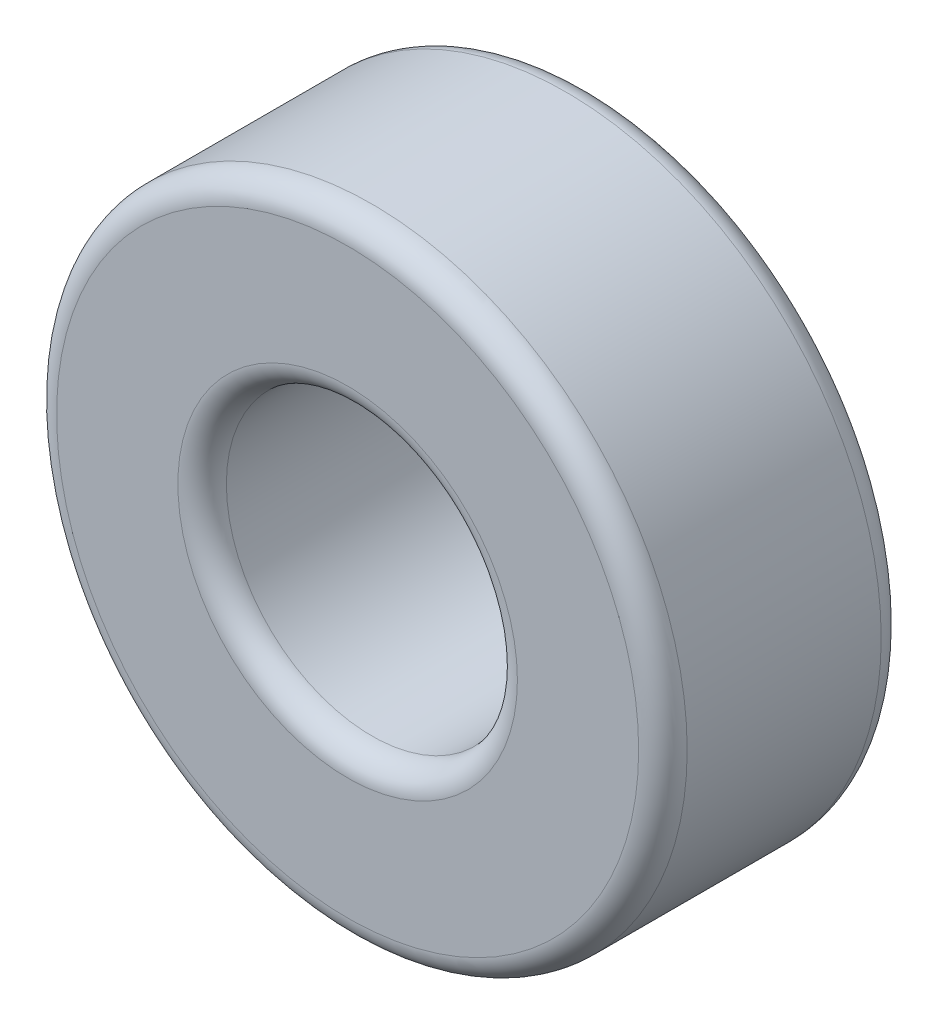
ISO-10303-21;
HEADER;
FILE_DESCRIPTION(('STEP AP214'),'2;1');
FILE_NAME('part.step','',(''),(''),'','','');
FILE_SCHEMA(('AUTOMOTIVE_DESIGN { 1 0 10303 214 1 1 1 1 }'));
ENDSEC;
DATA;
#1=APPLICATION_CONTEXT('core data for automotive mechanical design processes');
#2=APPLICATION_PROTOCOL_DEFINITION('international standard','automotive_design',2000,#1);
#3=PRODUCT_CONTEXT('',#1,'mechanical');
#4=PRODUCT('Part','Part','',(#3));
#5=PRODUCT_RELATED_PRODUCT_CATEGORY('part','',(#4));
#6=PRODUCT_DEFINITION_FORMATION('','',#4);
#7=PRODUCT_DEFINITION_CONTEXT('part definition',#1,'design');
#8=PRODUCT_DEFINITION('design','',#6,#7);
#9=PRODUCT_DEFINITION_SHAPE('','',#8);
#10=(LENGTH_UNIT() NAMED_UNIT(*) SI_UNIT(.MILLI.,.METRE.));
#11=(NAMED_UNIT(*) PLANE_ANGLE_UNIT() SI_UNIT($,.RADIAN.));
#12=(NAMED_UNIT(*) SI_UNIT($,.STERADIAN.) SOLID_ANGLE_UNIT());
#13=UNCERTAINTY_MEASURE_WITH_UNIT(LENGTH_MEASURE(1.E-05),#10,'distance_accuracy_value','');
#14=(GEOMETRIC_REPRESENTATION_CONTEXT(3) GLOBAL_UNCERTAINTY_ASSIGNED_CONTEXT((#13)) GLOBAL_UNIT_ASSIGNED_CONTEXT((#10,
#11,#12)) REPRESENTATION_CONTEXT('',''));
#15=CARTESIAN_POINT('',(0.,0.,0.));
#16=DIRECTION('',(0.,0.,1.));
#17=DIRECTION('',(1.,0.,0.));
#18=AXIS2_PLACEMENT_3D('',#15,#16,#17);
#19=CARTESIAN_POINT('',(0.,0.,0.));
#20=DIRECTION('',(0.,0.,1.));
#21=DIRECTION('',(1.,0.,0.));
#22=AXIS2_PLACEMENT_3D('',#19,#20,#21);
#23=CYLINDRICAL_SURFACE('',#22,3.);
#24=CARTESIAN_POINT('',(0.,0.,0.5));
#25=DIRECTION('',(0.,0.,1.));
#26=DIRECTION('',(1.,0.,0.));
#27=AXIS2_PLACEMENT_3D('',#24,#25,#26);
#28=CIRCLE('',#27,3.);
#29=CARTESIAN_POINT('',(3.,0.,0.5));
#30=VERTEX_POINT('',#29);
#31=EDGE_CURVE('E108',#30,#30,#28,.T.);
#32=ORIENTED_EDGE('',*,*,#31,.F.);
#33=EDGE_LOOP('',(#32));
#34=FACE_BOUND('',#33,.T.);
#35=CARTESIAN_POINT('',(0.,0.,4.5));
#36=DIRECTION('',(0.,0.,-1.));
#37=DIRECTION('',(-1.,0.,0.));
#38=AXIS2_PLACEMENT_3D('',#35,#36,#37);
#39=CIRCLE('',#38,3.);
#40=CARTESIAN_POINT('',(-3.,0.,4.5));
#41=VERTEX_POINT('',#40);
#42=EDGE_CURVE('E112',#41,#41,#39,.T.);
#43=ORIENTED_EDGE('',*,*,#42,.F.);
#44=EDGE_LOOP('',(#43));
#45=FACE_BOUND('',#44,.T.);
#46=ADVANCED_FACE('F15',(#34,#45),#23,.F.);
#47=CARTESIAN_POINT('',(0.,0.,4.5));
#48=DIRECTION('',(0.,0.,-1.));
#49=DIRECTION('',(-1.,0.,0.));
#50=AXIS2_PLACEMENT_3D('',#47,#48,#49);
#51=TOROIDAL_SURFACE('',#50,3.5,0.5);
#52=CARTESIAN_POINT('',(0.,0.,5.));
#53=DIRECTION('',(0.,0.,1.));
#54=DIRECTION('',(1.,0.,0.));
#55=AXIS2_PLACEMENT_3D('',#52,#53,#54);
#56=CIRCLE('',#55,3.5);
#57=CARTESIAN_POINT('',(3.5,0.,5.));
#58=VERTEX_POINT('',#57);
#59=EDGE_CURVE('E111',#58,#58,#56,.F.);
#60=ORIENTED_EDGE('',*,*,#59,.F.);
#61=EDGE_LOOP('',(#60));
#62=FACE_BOUND('',#61,.T.);
#63=ORIENTED_EDGE('',*,*,#42,.T.);
#64=EDGE_LOOP('',(#63));
#65=FACE_BOUND('',#64,.T.);
#66=ADVANCED_FACE('F131',(#62,#65),#51,.T.);
#67=CARTESIAN_POINT('',(0.,0.,0.5));
#68=DIRECTION('',(0.,0.,1.));
#69=DIRECTION('',(1.,0.,0.));
#70=AXIS2_PLACEMENT_3D('',#67,#68,#69);
#71=TOROIDAL_SURFACE('',#70,3.5,0.5);
#72=CARTESIAN_POINT('',(0.,0.,0.));
#73=DIRECTION('',(0.,0.,-1.));
#74=DIRECTION('',(1.,0.,0.));
#75=AXIS2_PLACEMENT_3D('',#72,#73,#74);
#76=CIRCLE('',#75,3.5);
#77=CARTESIAN_POINT('',(3.5,0.,0.));
#78=VERTEX_POINT('',#77);
#79=EDGE_CURVE('E119',#78,#78,#76,.T.);
#80=ORIENTED_EDGE('',*,*,#79,.T.);
#81=EDGE_LOOP('',(#80));
#82=FACE_BOUND('',#81,.T.);
#83=ORIENTED_EDGE('',*,*,#31,.T.);
#84=EDGE_LOOP('',(#83));
#85=FACE_BOUND('',#84,.T.);
#86=ADVANCED_FACE('F83',(#82,#85),#71,.T.);
#87=CARTESIAN_POINT('',(0.,0.,5.));
#88=DIRECTION('',(0.,0.,1.));
#89=DIRECTION('',(1.,0.,0.));
#90=AXIS2_PLACEMENT_3D('',#87,#88,#89);
#91=PLANE('',#90);
#92=ORIENTED_EDGE('',*,*,#59,.T.);
#93=EDGE_LOOP('',(#92));
#94=FACE_BOUND('',#93,.T.);
#95=CARTESIAN_POINT('',(0.,0.,5.));
#96=DIRECTION('',(0.,0.,-1.));
#97=DIRECTION('',(1.,0.,0.));
#98=AXIS2_PLACEMENT_3D('',#95,#96,#97);
#99=CIRCLE('',#98,6.);
#100=CARTESIAN_POINT('',(6.,0.,5.));
#101=VERTEX_POINT('',#100);
#102=EDGE_CURVE('E66',#101,#101,#99,.T.);
#103=ORIENTED_EDGE('',*,*,#102,.F.);
#104=EDGE_LOOP('',(#103));
#105=FACE_BOUND('',#104,.T.);
#106=ADVANCED_FACE('F73',(#94,#105),#91,.T.);
#107=CARTESIAN_POINT('',(0.,0.,0.));
#108=DIRECTION('',(0.,0.,1.));
#109=DIRECTION('',(1.,0.,0.));
#110=AXIS2_PLACEMENT_3D('',#107,#108,#109);
#111=PLANE('',#110);
#112=ORIENTED_EDGE('',*,*,#79,.F.);
#113=EDGE_LOOP('',(#112));
#114=FACE_BOUND('',#113,.T.);
#115=CARTESIAN_POINT('',(0.,0.,0.));
#116=DIRECTION('',(0.,0.,1.));
#117=DIRECTION('',(1.,0.,0.));
#118=AXIS2_PLACEMENT_3D('',#115,#116,#117);
#119=CIRCLE('',#118,6.);
#120=CARTESIAN_POINT('',(6.,0.,0.));
#121=VERTEX_POINT('',#120);
#122=EDGE_CURVE('E28',#121,#121,#119,.T.);
#123=ORIENTED_EDGE('',*,*,#122,.F.);
#124=EDGE_LOOP('',(#123));
#125=FACE_BOUND('',#124,.T.);
#126=ADVANCED_FACE('F82',(#114,#125),#111,.F.);
#127=CARTESIAN_POINT('',(0.,0.,4.5));
#128=DIRECTION('',(0.,0.,1.));
#129=DIRECTION('',(1.,0.,0.));
#130=AXIS2_PLACEMENT_3D('',#127,#128,#129);
#131=TOROIDAL_SURFACE('',#130,6.,0.5);
#132=ORIENTED_EDGE('',*,*,#102,.T.);
#133=EDGE_LOOP('',(#132));
#134=FACE_BOUND('',#133,.T.);
#135=CARTESIAN_POINT('',(0.,0.,4.5));
#136=DIRECTION('',(0.,0.,1.));
#137=DIRECTION('',(1.,0.,0.));
#138=AXIS2_PLACEMENT_3D('',#135,#136,#137);
#139=CIRCLE('',#138,6.5);
#140=CARTESIAN_POINT('',(6.5,0.,4.5));
#141=VERTEX_POINT('',#140);
#142=EDGE_CURVE('E23',#141,#141,#139,.F.);
#143=ORIENTED_EDGE('',*,*,#142,.F.);
#144=EDGE_LOOP('',(#143));
#145=FACE_BOUND('',#144,.T.);
#146=ADVANCED_FACE('F46',(#134,#145),#131,.T.);
#147=CARTESIAN_POINT('',(0.,0.,0.5));
#148=DIRECTION('',(0.,0.,-1.));
#149=DIRECTION('',(-1.,0.,0.));
#150=AXIS2_PLACEMENT_3D('',#147,#148,#149);
#151=TOROIDAL_SURFACE('',#150,6.,0.5);
#152=ORIENTED_EDGE('',*,*,#122,.T.);
#153=EDGE_LOOP('',(#152));
#154=FACE_BOUND('',#153,.T.);
#155=CARTESIAN_POINT('',(0.,0.,0.5));
#156=DIRECTION('',(0.,0.,1.));
#157=DIRECTION('',(1.,0.,0.));
#158=AXIS2_PLACEMENT_3D('',#155,#156,#157);
#159=CIRCLE('',#158,6.5);
#160=CARTESIAN_POINT('',(6.5,0.,0.5));
#161=VERTEX_POINT('',#160);
#162=EDGE_CURVE('E10',#161,#161,#159,.T.);
#163=ORIENTED_EDGE('',*,*,#162,.F.);
#164=EDGE_LOOP('',(#163));
#165=FACE_BOUND('',#164,.T.);
#166=ADVANCED_FACE('F40',(#154,#165),#151,.T.);
#167=CARTESIAN_POINT('',(0.,0.,0.));
#168=DIRECTION('',(0.,0.,1.));
#169=DIRECTION('',(1.,0.,0.));
#170=AXIS2_PLACEMENT_3D('',#167,#168,#169);
#171=CYLINDRICAL_SURFACE('',#170,6.5);
#172=ORIENTED_EDGE('',*,*,#162,.T.);
#173=EDGE_LOOP('',(#172));
#174=FACE_BOUND('',#173,.T.);
#175=ORIENTED_EDGE('',*,*,#142,.T.);
#176=EDGE_LOOP('',(#175));
#177=FACE_BOUND('',#176,.T.);
#178=ADVANCED_FACE('F45',(#174,#177),#171,.T.);
#179=CLOSED_SHELL('',(#46,#66,#86,#106,#126,#146,#166,#178));
#180=MANIFOLD_SOLID_BREP('B1',#179);
#181=ADVANCED_BREP_SHAPE_REPRESENTATION('',(#18,#180),#14);
#182=SHAPE_DEFINITION_REPRESENTATION(#9,#181);
ENDSEC;
END-ISO-10303-21;
